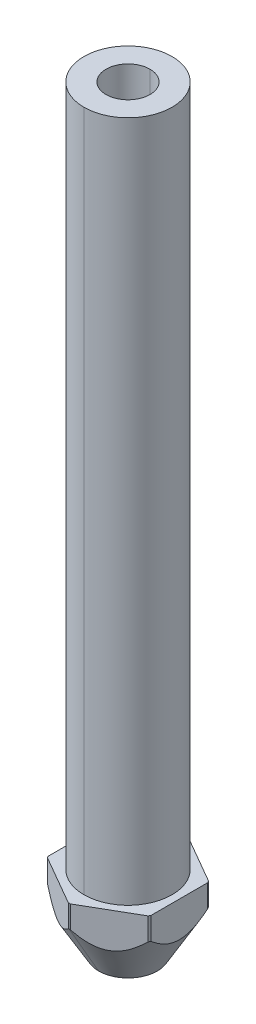
ISO-10303-21;
HEADER;
FILE_DESCRIPTION(('STEP AP214'),'2;1');
FILE_NAME('part.step','',(''),(''),'','','');
FILE_SCHEMA(('AUTOMOTIVE_DESIGN { 1 0 10303 214 1 1 1 1 }'));
ENDSEC;
DATA;
#1=APPLICATION_CONTEXT('core data for automotive mechanical design processes');
#2=APPLICATION_PROTOCOL_DEFINITION('international standard','automotive_design',2000,#1);
#3=PRODUCT_CONTEXT('',#1,'mechanical');
#4=PRODUCT('Part','Part','',(#3));
#5=PRODUCT_RELATED_PRODUCT_CATEGORY('part','',(#4));
#6=PRODUCT_DEFINITION_FORMATION('','',#4);
#7=PRODUCT_DEFINITION_CONTEXT('part definition',#1,'design');
#8=PRODUCT_DEFINITION('design','',#6,#7);
#9=PRODUCT_DEFINITION_SHAPE('','',#8);
#10=(LENGTH_UNIT() NAMED_UNIT(*) SI_UNIT(.MILLI.,.METRE.));
#11=(NAMED_UNIT(*) PLANE_ANGLE_UNIT() SI_UNIT($,.RADIAN.));
#12=(NAMED_UNIT(*) SI_UNIT($,.STERADIAN.) SOLID_ANGLE_UNIT());
#13=UNCERTAINTY_MEASURE_WITH_UNIT(LENGTH_MEASURE(1.E-05),#10,'distance_accuracy_value','');
#14=(GEOMETRIC_REPRESENTATION_CONTEXT(3) GLOBAL_UNCERTAINTY_ASSIGNED_CONTEXT((#13)) GLOBAL_UNIT_ASSIGNED_CONTEXT((#10,
#11,#12)) REPRESENTATION_CONTEXT('',''));
#15=CARTESIAN_POINT('',(0.,0.,0.));
#16=DIRECTION('',(0.,0.,1.));
#17=DIRECTION('',(1.,0.,0.));
#18=AXIS2_PLACEMENT_3D('',#15,#16,#17);
#19=CARTESIAN_POINT('',(0.,0.,0.));
#20=DIRECTION('',(0.,1.,0.));
#21=DIRECTION('',(0.,0.,1.));
#22=AXIS2_PLACEMENT_3D('',#19,#20,#21);
#23=CYLINDRICAL_SURFACE('',#22,1.5);
#24=DIRECTION('',(0.,1.,0.));
#25=VECTOR('',#24,1.);
#26=CARTESIAN_POINT('',(0.,0.,-1.5));
#27=LINE('',#26,#25);
#28=CARTESIAN_POINT('',(0.,-51.5,-1.5));
#29=VERTEX_POINT('',#28);
#30=CARTESIAN_POINT('',(0.,0.,-1.5));
#31=VERTEX_POINT('',#30);
#32=EDGE_CURVE('E218',#29,#31,#27,.T.);
#33=ORIENTED_EDGE('',*,*,#32,.F.);
#34=CARTESIAN_POINT('',(0.,-51.5,0.));
#35=DIRECTION('',(0.,1.,0.));
#36=DIRECTION('',(0.,0.,1.));
#37=AXIS2_PLACEMENT_3D('',#34,#35,#36);
#38=CIRCLE('',#37,1.5);
#39=CARTESIAN_POINT('',(0.,-51.5,1.5));
#40=VERTEX_POINT('',#39);
#41=EDGE_CURVE('E206',#40,#29,#38,.T.);
#42=ORIENTED_EDGE('',*,*,#41,.F.);
#43=DIRECTION('',(0.,1.,0.));
#44=VECTOR('',#43,1.);
#45=CARTESIAN_POINT('',(0.,0.,1.5));
#46=LINE('',#45,#44);
#47=CARTESIAN_POINT('',(0.,0.,1.5));
#48=VERTEX_POINT('',#47);
#49=EDGE_CURVE('E227',#40,#48,#46,.T.);
#50=ORIENTED_EDGE('',*,*,#49,.T.);
#51=CARTESIAN_POINT('',(0.,0.,0.));
#52=DIRECTION('',(0.,1.,0.));
#53=DIRECTION('',(0.,0.,1.));
#54=AXIS2_PLACEMENT_3D('',#51,#52,#53);
#55=CIRCLE('',#54,1.5);
#56=EDGE_CURVE('E219',#48,#31,#55,.T.);
#57=ORIENTED_EDGE('',*,*,#56,.T.);
#58=EDGE_LOOP('',(#33,#42,#50,#57));
#59=FACE_BOUND('',#58,.T.);
#60=ADVANCED_FACE('F17',(#59),#23,.F.);
#61=CARTESIAN_POINT('',(0.,0.,0.));
#62=DIRECTION('',(0.,1.,0.));
#63=DIRECTION('',(0.,0.,1.));
#64=AXIS2_PLACEMENT_3D('',#61,#62,#63);
#65=CYLINDRICAL_SURFACE('',#64,3.);
#66=DIRECTION('',(0.,1.,0.));
#67=VECTOR('',#66,1.);
#68=CARTESIAN_POINT('',(0.,0.,-3.));
#69=LINE('',#68,#67);
#70=CARTESIAN_POINT('',(0.,-46.5,-3.));
#71=VERTEX_POINT('',#70);
#72=CARTESIAN_POINT('',(0.,0.,-3.));
#73=VERTEX_POINT('',#72);
#74=EDGE_CURVE('E416',#71,#73,#69,.T.);
#75=ORIENTED_EDGE('',*,*,#74,.F.);
#76=CARTESIAN_POINT('',(0.,-46.5,0.));
#77=DIRECTION('',(0.,1.,0.));
#78=DIRECTION('',(0.,0.,1.));
#79=AXIS2_PLACEMENT_3D('',#76,#77,#78);
#80=CIRCLE('',#79,3.);
#81=CARTESIAN_POINT('',(0.,-46.5,3.));
#82=VERTEX_POINT('',#81);
#83=EDGE_CURVE('E11',#71,#82,#80,.T.);
#84=ORIENTED_EDGE('',*,*,#83,.T.);
#85=DIRECTION('',(0.,1.,0.));
#86=VECTOR('',#85,1.);
#87=CARTESIAN_POINT('',(0.,0.,3.));
#88=LINE('',#87,#86);
#89=CARTESIAN_POINT('',(0.,0.,3.));
#90=VERTEX_POINT('',#89);
#91=EDGE_CURVE('E367',#82,#90,#88,.T.);
#92=ORIENTED_EDGE('',*,*,#91,.T.);
#93=CARTESIAN_POINT('',(0.,0.,0.));
#94=DIRECTION('',(0.,1.,0.));
#95=DIRECTION('',(0.,0.,1.));
#96=AXIS2_PLACEMENT_3D('',#93,#94,#95);
#97=CIRCLE('',#96,3.);
#98=EDGE_CURVE('E111',#73,#90,#97,.T.);
#99=ORIENTED_EDGE('',*,*,#98,.F.);
#100=EDGE_LOOP('',(#75,#84,#92,#99));
#101=FACE_BOUND('',#100,.T.);
#102=ADVANCED_FACE('F512',(#101),#65,.T.);
#103=CARTESIAN_POINT('',(0.,-51.5,0.));
#104=DIRECTION('',(0.,1.,0.));
#105=DIRECTION('',(0.,0.,1.));
#106=AXIS2_PLACEMENT_3D('',#103,#104,#105);
#107=CONICAL_SURFACE('',#106,2.,0.523598775598299);
#108=DIRECTION('',(0.,0.866025403784439,-0.5));
#109=VECTOR('',#108,1.);
#110=CARTESIAN_POINT('',(0.,-51.5,-2.));
#111=LINE('',#110,#109);
#112=CARTESIAN_POINT('',(0.,-51.5,-2.));
#113=VERTEX_POINT('',#112);
#114=CARTESIAN_POINT('',(0.,-48.0358983848622,-4.));
#115=VERTEX_POINT('',#114);
#116=EDGE_CURVE('E21',#113,#115,#111,.T.);
#117=ORIENTED_EDGE('',*,*,#116,.F.);
#118=CARTESIAN_POINT('',(0.,-51.5,0.));
#119=DIRECTION('',(0.,1.,0.));
#120=DIRECTION('',(0.,0.,1.));
#121=AXIS2_PLACEMENT_3D('',#118,#119,#120);
#122=CIRCLE('',#121,2.);
#123=CARTESIAN_POINT('',(0.,-51.5,2.));
#124=VERTEX_POINT('',#123);
#125=EDGE_CURVE('E96',#113,#124,#122,.T.);
#126=ORIENTED_EDGE('',*,*,#125,.T.);
#127=DIRECTION('',(0.,0.866025403784439,0.5));
#128=VECTOR('',#127,1.);
#129=CARTESIAN_POINT('',(0.,-51.5,2.));
#130=LINE('',#129,#128);
#131=CARTESIAN_POINT('',(0.,-48.0358983848622,4.));
#132=VERTEX_POINT('',#131);
#133=EDGE_CURVE('E307',#124,#132,#130,.T.);
#134=ORIENTED_EDGE('',*,*,#133,.T.);
#135=CARTESIAN_POINT('',(0.,-48.0358983848622,0.));
#136=DIRECTION('',(0.,1.,0.));
#137=DIRECTION('',(0.,0.,1.));
#138=AXIS2_PLACEMENT_3D('',#135,#136,#137);
#139=CIRCLE('',#138,4.);
#140=CARTESIAN_POINT('',(-0.0729490168751533,-48.0358983848622,3.99933474979739));
#141=VERTEX_POINT('',#140);
#142=EDGE_CURVE('E309',#141,#132,#139,.T.);
#143=ORIENTED_EDGE('',*,*,#142,.F.);
#144=CARTESIAN_POINT('',(-3.42705098312485,-48.0358983848623,2.06284307669368));
#145=CARTESIAN_POINT('',(-1.75000000000001,-49.6596960169581,3.03108891324553));
#146=CARTESIAN_POINT('',(-0.0729490168751533,-48.0358983848623,3.99933474979739));
#147=(BOUNDED_CURVE() B_SPLINE_CURVE(2,(#144,#145,#146),.UNSPECIFIED.,.F.,
.F.) B_SPLINE_CURVE_WITH_KNOTS((3,3),(-0.838145031465155,-0.242215869795367),
.UNSPECIFIED.) CURVE() GEOMETRIC_REPRESENTATION_ITEM() RATIONAL_B_SPLINE_CURVE((1.19521354868503,
1.36595834135432,1.19521354868503)) REPRESENTATION_ITEM(''));
#148=CARTESIAN_POINT('',(-3.42705098312485,-48.0358983848622,2.06284307669368));
#149=VERTEX_POINT('',#148);
#150=EDGE_CURVE('E256',#149,#141,#147,.T.);
#151=ORIENTED_EDGE('',*,*,#150,.F.);
#152=CARTESIAN_POINT('',(0.,-48.0358983848622,0.));
#153=DIRECTION('',(0.,1.,0.));
#154=DIRECTION('',(0.,0.,1.));
#155=AXIS2_PLACEMENT_3D('',#152,#153,#154);
#156=CIRCLE('',#155,4.);
#157=CARTESIAN_POINT('',(-3.5,-48.0358983848622,1.93649167310372));
#158=VERTEX_POINT('',#157);
#159=EDGE_CURVE('E43',#158,#149,#156,.T.);
#160=ORIENTED_EDGE('',*,*,#159,.F.);
#161=CARTESIAN_POINT('',(-3.5,-48.0358983848623,-1.93649167310372));
#162=CARTESIAN_POINT('',(-3.5,-49.6596960169581,0.));
#163=CARTESIAN_POINT('',(-3.5,-48.0358983848623,1.93649167310372));
#164=(BOUNDED_CURVE() B_SPLINE_CURVE(2,(#161,#162,#163),.UNSPECIFIED.,.F.,
.F.) B_SPLINE_CURVE_WITH_KNOTS((3,3),(-0.838145031465153,-0.242215869795367),
.UNSPECIFIED.) CURVE() GEOMETRIC_REPRESENTATION_ITEM() RATIONAL_B_SPLINE_CURVE((1.19521354868503,
1.36595834135432,1.19521354868503)) REPRESENTATION_ITEM(''));
#165=CARTESIAN_POINT('',(-3.5,-48.0358983848622,-1.93649167310372));
#166=VERTEX_POINT('',#165);
#167=EDGE_CURVE('E246',#166,#158,#164,.T.);
#168=ORIENTED_EDGE('',*,*,#167,.F.);
#169=CARTESIAN_POINT('',(0.,-48.0358983848622,0.));
#170=DIRECTION('',(0.,1.,0.));
#171=DIRECTION('',(0.,0.,1.));
#172=AXIS2_PLACEMENT_3D('',#169,#170,#171);
#173=CIRCLE('',#172,4.);
#174=CARTESIAN_POINT('',(-3.42705098312485,-48.0358983848622,-2.06284307669368));
#175=VERTEX_POINT('',#174);
#176=EDGE_CURVE('E297',#175,#166,#173,.T.);
#177=ORIENTED_EDGE('',*,*,#176,.F.);
#178=CARTESIAN_POINT('',(-0.0729490168751544,-48.0358983848623,-3.99933474979739));
#179=CARTESIAN_POINT('',(-1.75,-49.6596960169581,-3.03108891324553));
#180=CARTESIAN_POINT('',(-3.42705098312485,-48.0358983848623,-2.06284307669368));
#181=(BOUNDED_CURVE() B_SPLINE_CURVE(2,(#178,#179,#180),.UNSPECIFIED.,.F.,
.F.) B_SPLINE_CURVE_WITH_KNOTS((3,3),(-0.838145031465148,-0.242215869795368),
.UNSPECIFIED.) CURVE() GEOMETRIC_REPRESENTATION_ITEM() RATIONAL_B_SPLINE_CURVE((1.19521354868503,
1.36595834135431,1.19521354868503)) REPRESENTATION_ITEM(''));
#182=CARTESIAN_POINT('',(-0.0729490168751544,-48.0358983848622,-3.99933474979739));
#183=VERTEX_POINT('',#182);
#184=EDGE_CURVE('E257',#183,#175,#181,.T.);
#185=ORIENTED_EDGE('',*,*,#184,.F.);
#186=CARTESIAN_POINT('',(0.,-48.0358983848622,0.));
#187=DIRECTION('',(0.,1.,0.));
#188=DIRECTION('',(0.,0.,1.));
#189=AXIS2_PLACEMENT_3D('',#186,#187,#188);
#190=CIRCLE('',#189,4.);
#191=EDGE_CURVE('E274',#115,#183,#190,.T.);
#192=ORIENTED_EDGE('',*,*,#191,.F.);
#193=EDGE_LOOP('',(#117,#126,#134,#143,#151,#160,#168,#177,#185,#192));
#194=FACE_BOUND('',#193,.T.);
#195=ADVANCED_FACE('F443',(#194),#107,.T.);
#196=CARTESIAN_POINT('',(0.,0.,0.));
#197=DIRECTION('',(0.,1.,0.));
#198=DIRECTION('',(0.,0.,1.));
#199=AXIS2_PLACEMENT_3D('',#196,#197,#198);
#200=CYLINDRICAL_SURFACE('',#199,4.);
#201=DIRECTION('',(0.,1.,0.));
#202=VECTOR('',#201,1.);
#203=CARTESIAN_POINT('',(0.,0.,4.));
#204=LINE('',#203,#202);
#205=CARTESIAN_POINT('',(0.,-46.5,4.));
#206=VERTEX_POINT('',#205);
#207=EDGE_CURVE('E306',#132,#206,#204,.T.);
#208=ORIENTED_EDGE('',*,*,#207,.F.);
#209=CARTESIAN_POINT('',(0.,-48.0358983848622,0.));
#210=DIRECTION('',(0.,1.,0.));
#211=DIRECTION('',(0.,0.,1.));
#212=AXIS2_PLACEMENT_3D('',#209,#210,#211);
#213=CIRCLE('',#212,4.);
#214=CARTESIAN_POINT('',(0.0729490168751524,-48.0358983848622,3.99933474979739));
#215=VERTEX_POINT('',#214);
#216=EDGE_CURVE('E310',#132,#215,#213,.T.);
#217=ORIENTED_EDGE('',*,*,#216,.T.);
#218=DIRECTION('',(0.,-1.,0.));
#219=VECTOR('',#218,1.);
#220=CARTESIAN_POINT('',(0.0729490168751524,0.,3.99933474979739));
#221=LINE('',#220,#219);
#222=CARTESIAN_POINT('',(0.0729490168751524,-46.5,3.99933474979739));
#223=VERTEX_POINT('',#222);
#224=EDGE_CURVE('E251',#223,#215,#221,.T.);
#225=ORIENTED_EDGE('',*,*,#224,.F.);
#226=CARTESIAN_POINT('',(0.,-46.5,0.));
#227=DIRECTION('',(0.,1.,0.));
#228=DIRECTION('',(0.,0.,1.));
#229=AXIS2_PLACEMENT_3D('',#226,#227,#228);
#230=CIRCLE('',#229,4.);
#231=EDGE_CURVE('E28',#206,#223,#230,.T.);
#232=ORIENTED_EDGE('',*,*,#231,.F.);
#233=EDGE_LOOP('',(#208,#217,#225,#232));
#234=FACE_BOUND('',#233,.T.);
#235=ADVANCED_FACE('F538',(#234),#200,.T.);
#236=CARTESIAN_POINT('',(0.,-46.5,0.));
#237=DIRECTION('',(0.,1.,0.));
#238=DIRECTION('',(1.,0.,0.));
#239=AXIS2_PLACEMENT_3D('',#236,#237,#238);
#240=PLANE('',#239);
#241=CARTESIAN_POINT('',(0.,-46.5,0.));
#242=DIRECTION('',(0.,1.,0.));
#243=DIRECTION('',(0.,0.,1.));
#244=AXIS2_PLACEMENT_3D('',#241,#242,#243);
#245=CIRCLE('',#244,3.);
#246=EDGE_CURVE('E345',#82,#71,#245,.T.);
#247=ORIENTED_EDGE('',*,*,#246,.F.);
#248=ORIENTED_EDGE('',*,*,#83,.F.);
#249=EDGE_LOOP('',(#247,#248));
#250=FACE_BOUND('',#249,.T.);
#251=CARTESIAN_POINT('',(0.,-46.5,0.));
#252=DIRECTION('',(0.,1.,0.));
#253=DIRECTION('',(0.,0.,1.));
#254=AXIS2_PLACEMENT_3D('',#251,#252,#253);
#255=CIRCLE('',#254,4.);
#256=CARTESIAN_POINT('',(-3.42705098312485,-46.5,-2.06284307669368));
#257=VERTEX_POINT('',#256);
#258=CARTESIAN_POINT('',(-3.5,-46.5,-1.93649167310372));
#259=VERTEX_POINT('',#258);
#260=EDGE_CURVE('E300',#257,#259,#255,.T.);
#261=ORIENTED_EDGE('',*,*,#260,.T.);
#262=DIRECTION('',(0.,0.,1.));
#263=VECTOR('',#262,1.);
#264=CARTESIAN_POINT('',(-3.5,-46.5,0.));
#265=LINE('',#264,#263);
#266=CARTESIAN_POINT('',(-3.5,-46.5,1.93649167310372));
#267=VERTEX_POINT('',#266);
#268=EDGE_CURVE('E245',#259,#267,#265,.T.);
#269=ORIENTED_EDGE('',*,*,#268,.T.);
#270=CARTESIAN_POINT('',(0.,-46.5,0.));
#271=DIRECTION('',(0.,1.,0.));
#272=DIRECTION('',(0.,0.,1.));
#273=AXIS2_PLACEMENT_3D('',#270,#271,#272);
#274=CIRCLE('',#273,4.);
#275=CARTESIAN_POINT('',(-3.42705098312485,-46.5,2.06284307669368));
#276=VERTEX_POINT('',#275);
#277=EDGE_CURVE('E241',#267,#276,#274,.T.);
#278=ORIENTED_EDGE('',*,*,#277,.T.);
#279=DIRECTION('',(0.866025403784439,0.,0.5));
#280=VECTOR('',#279,1.);
#281=CARTESIAN_POINT('',(-1.75,-46.5,3.03108891324554));
#282=LINE('',#281,#280);
#283=CARTESIAN_POINT('',(-0.0729490168751533,-46.5,3.99933474979739));
#284=VERTEX_POINT('',#283);
#285=EDGE_CURVE('E252',#276,#284,#282,.T.);
#286=ORIENTED_EDGE('',*,*,#285,.T.);
#287=CARTESIAN_POINT('',(0.,-46.5,0.));
#288=DIRECTION('',(0.,1.,0.));
#289=DIRECTION('',(0.,0.,1.));
#290=AXIS2_PLACEMENT_3D('',#287,#288,#289);
#291=CIRCLE('',#290,4.);
#292=EDGE_CURVE('E301',#284,#206,#291,.T.);
#293=ORIENTED_EDGE('',*,*,#292,.T.);
#294=ORIENTED_EDGE('',*,*,#231,.T.);
#295=DIRECTION('',(0.866025403784439,0.,-0.5));
#296=VECTOR('',#295,1.);
#297=CARTESIAN_POINT('',(1.75,-46.5,3.03108891324554));
#298=LINE('',#297,#296);
#299=CARTESIAN_POINT('',(3.42705098312485,-46.5,2.06284307669368));
#300=VERTEX_POINT('',#299);
#301=EDGE_CURVE('E250',#223,#300,#298,.T.);
#302=ORIENTED_EDGE('',*,*,#301,.T.);
#303=CARTESIAN_POINT('',(0.,-46.5,0.));
#304=DIRECTION('',(0.,1.,0.));
#305=DIRECTION('',(0.,0.,1.));
#306=AXIS2_PLACEMENT_3D('',#303,#304,#305);
#307=CIRCLE('',#306,4.);
#308=CARTESIAN_POINT('',(3.5,-46.5,1.93649167310372));
#309=VERTEX_POINT('',#308);
#310=EDGE_CURVE('E177',#300,#309,#307,.T.);
#311=ORIENTED_EDGE('',*,*,#310,.T.);
#312=DIRECTION('',(0.,0.,-1.));
#313=VECTOR('',#312,1.);
#314=CARTESIAN_POINT('',(3.5,-46.5,0.));
#315=LINE('',#314,#313);
#316=CARTESIAN_POINT('',(3.5,-46.5,-1.93649167310372));
#317=VERTEX_POINT('',#316);
#318=EDGE_CURVE('E281',#309,#317,#315,.T.);
#319=ORIENTED_EDGE('',*,*,#318,.T.);
#320=CARTESIAN_POINT('',(0.,-46.5,0.));
#321=DIRECTION('',(0.,1.,0.));
#322=DIRECTION('',(0.,0.,1.));
#323=AXIS2_PLACEMENT_3D('',#320,#321,#322);
#324=CIRCLE('',#323,4.);
#325=CARTESIAN_POINT('',(3.42705098312485,-46.5,-2.06284307669368));
#326=VERTEX_POINT('',#325);
#327=EDGE_CURVE('E188',#317,#326,#324,.T.);
#328=ORIENTED_EDGE('',*,*,#327,.T.);
#329=DIRECTION('',(-0.866025403784439,0.,-0.5));
#330=VECTOR('',#329,1.);
#331=CARTESIAN_POINT('',(1.75,-46.5,-3.03108891324554));
#332=LINE('',#331,#330);
#333=CARTESIAN_POINT('',(0.0729490168751509,-46.5,-3.99933474979739));
#334=VERTEX_POINT('',#333);
#335=EDGE_CURVE('E273',#326,#334,#332,.T.);
#336=ORIENTED_EDGE('',*,*,#335,.T.);
#337=CARTESIAN_POINT('',(0.,-46.5,0.));
#338=DIRECTION('',(0.,1.,0.));
#339=DIRECTION('',(0.,0.,1.));
#340=AXIS2_PLACEMENT_3D('',#337,#338,#339);
#341=CIRCLE('',#340,4.);
#342=CARTESIAN_POINT('',(0.,-46.5,-4.));
#343=VERTEX_POINT('',#342);
#344=EDGE_CURVE('E286',#334,#343,#341,.T.);
#345=ORIENTED_EDGE('',*,*,#344,.T.);
#346=CARTESIAN_POINT('',(0.,-46.5,0.));
#347=DIRECTION('',(0.,1.,0.));
#348=DIRECTION('',(0.,0.,1.));
#349=AXIS2_PLACEMENT_3D('',#346,#347,#348);
#350=CIRCLE('',#349,4.);
#351=CARTESIAN_POINT('',(-0.0729490168751544,-46.5,-3.99933474979739));
#352=VERTEX_POINT('',#351);
#353=EDGE_CURVE('E277',#343,#352,#350,.T.);
#354=ORIENTED_EDGE('',*,*,#353,.T.);
#355=DIRECTION('',(-0.866025403784439,0.,0.5));
#356=VECTOR('',#355,1.);
#357=CARTESIAN_POINT('',(-1.75,-46.5,-3.03108891324554));
#358=LINE('',#357,#356);
#359=EDGE_CURVE('E290',#352,#257,#358,.T.);
#360=ORIENTED_EDGE('',*,*,#359,.T.);
#361=EDGE_LOOP('',(#261,#269,#278,#286,#293,#294,#302,#311,#319,#328,#336,#345,#354,#360));
#362=FACE_BOUND('',#361,.T.);
#363=ADVANCED_FACE('F452',(#250,#362),#240,.T.);
#364=CARTESIAN_POINT('',(0.,0.,0.));
#365=DIRECTION('',(0.,1.,0.));
#366=DIRECTION('',(0.,0.,1.));
#367=AXIS2_PLACEMENT_3D('',#364,#365,#366);
#368=CYLINDRICAL_SURFACE('',#367,4.);
#369=DIRECTION('',(0.,-1.,0.));
#370=VECTOR('',#369,1.);
#371=CARTESIAN_POINT('',(-3.5,0.,1.93649167310372));
#372=LINE('',#371,#370);
#373=EDGE_CURVE('E242',#267,#158,#372,.T.);
#374=ORIENTED_EDGE('',*,*,#373,.T.);
#375=ORIENTED_EDGE('',*,*,#159,.T.);
#376=DIRECTION('',(0.,-1.,0.));
#377=VECTOR('',#376,1.);
#378=CARTESIAN_POINT('',(-3.42705098312485,0.,2.06284307669368));
#379=LINE('',#378,#377);
#380=EDGE_CURVE('E394',#276,#149,#379,.T.);
#381=ORIENTED_EDGE('',*,*,#380,.F.);
#382=ORIENTED_EDGE('',*,*,#277,.F.);
#383=EDGE_LOOP('',(#374,#375,#381,#382));
#384=FACE_BOUND('',#383,.T.);
#385=ADVANCED_FACE('F450',(#384),#368,.T.);
#386=CARTESIAN_POINT('',(0.,0.,0.));
#387=DIRECTION('',(0.,1.,0.));
#388=DIRECTION('',(0.,0.,1.));
#389=AXIS2_PLACEMENT_3D('',#386,#387,#388);
#390=CYLINDRICAL_SURFACE('',#389,4.);
#391=DIRECTION('',(0.,-1.,0.));
#392=VECTOR('',#391,1.);
#393=CARTESIAN_POINT('',(-3.5,0.,-1.93649167310372));
#394=LINE('',#393,#392);
#395=EDGE_CURVE('E285',#259,#166,#394,.T.);
#396=ORIENTED_EDGE('',*,*,#395,.F.);
#397=ORIENTED_EDGE('',*,*,#260,.F.);
#398=DIRECTION('',(0.,-1.,0.));
#399=VECTOR('',#398,1.);
#400=CARTESIAN_POINT('',(-3.42705098312485,0.,-2.06284307669368));
#401=LINE('',#400,#399);
#402=EDGE_CURVE('E263',#257,#175,#401,.T.);
#403=ORIENTED_EDGE('',*,*,#402,.T.);
#404=ORIENTED_EDGE('',*,*,#176,.T.);
#405=EDGE_LOOP('',(#396,#397,#403,#404));
#406=FACE_BOUND('',#405,.T.);
#407=ADVANCED_FACE('F454',(#406),#390,.T.);
#408=CARTESIAN_POINT('',(0.,0.,0.));
#409=DIRECTION('',(0.,1.,0.));
#410=DIRECTION('',(0.,0.,-1.));
#411=AXIS2_PLACEMENT_3D('',#408,#409,#410);
#412=CYLINDRICAL_SURFACE('',#411,4.);
#413=DIRECTION('',(0.,1.,0.));
#414=VECTOR('',#413,1.);
#415=CARTESIAN_POINT('',(0.,0.,-4.));
#416=LINE('',#415,#414);
#417=EDGE_CURVE('E401',#115,#343,#416,.T.);
#418=ORIENTED_EDGE('',*,*,#417,.F.);
#419=ORIENTED_EDGE('',*,*,#191,.T.);
#420=DIRECTION('',(0.,-1.,0.));
#421=VECTOR('',#420,1.);
#422=CARTESIAN_POINT('',(-0.0729490168751544,0.,-3.99933474979739));
#423=LINE('',#422,#421);
#424=EDGE_CURVE('E264',#352,#183,#423,.T.);
#425=ORIENTED_EDGE('',*,*,#424,.F.);
#426=ORIENTED_EDGE('',*,*,#353,.F.);
#427=EDGE_LOOP('',(#418,#419,#425,#426));
#428=FACE_BOUND('',#427,.T.);
#429=ADVANCED_FACE('F467',(#428),#412,.T.);
#430=CARTESIAN_POINT('',(0.,0.,0.));
#431=DIRECTION('',(0.,1.,0.));
#432=DIRECTION('',(0.,0.,1.));
#433=AXIS2_PLACEMENT_3D('',#430,#431,#432);
#434=CYLINDRICAL_SURFACE('',#433,4.);
#435=DIRECTION('',(0.,-1.,0.));
#436=VECTOR('',#435,1.);
#437=CARTESIAN_POINT('',(3.42705098312485,0.,-2.06284307669368));
#438=LINE('',#437,#436);
#439=CARTESIAN_POINT('',(3.42705098312485,-48.0358983848622,-2.06284307669368));
#440=VERTEX_POINT('',#439);
#441=EDGE_CURVE('E294',#326,#440,#438,.T.);
#442=ORIENTED_EDGE('',*,*,#441,.F.);
#443=ORIENTED_EDGE('',*,*,#327,.F.);
#444=DIRECTION('',(0.,-1.,0.));
#445=VECTOR('',#444,1.);
#446=CARTESIAN_POINT('',(3.5,0.,-1.93649167310372));
#447=LINE('',#446,#445);
#448=CARTESIAN_POINT('',(3.5,-48.0358983848622,-1.93649167310372));
#449=VERTEX_POINT('',#448);
#450=EDGE_CURVE('E272',#317,#449,#447,.T.);
#451=ORIENTED_EDGE('',*,*,#450,.T.);
#452=CARTESIAN_POINT('',(0.,-48.0358983848622,0.));
#453=DIRECTION('',(0.,1.,0.));
#454=DIRECTION('',(0.,0.,1.));
#455=AXIS2_PLACEMENT_3D('',#452,#453,#454);
#456=CIRCLE('',#455,4.);
#457=EDGE_CURVE('E328',#449,#440,#456,.T.);
#458=ORIENTED_EDGE('',*,*,#457,.T.);
#459=EDGE_LOOP('',(#442,#443,#451,#458));
#460=FACE_BOUND('',#459,.T.);
#461=ADVANCED_FACE('F564',(#460),#434,.T.);
#462=CARTESIAN_POINT('',(0.,0.,0.));
#463=DIRECTION('',(0.,1.,0.));
#464=DIRECTION('',(0.,0.,1.));
#465=AXIS2_PLACEMENT_3D('',#462,#463,#464);
#466=CYLINDRICAL_SURFACE('',#465,4.);
#467=DIRECTION('',(0.,-1.,0.));
#468=VECTOR('',#467,1.);
#469=CARTESIAN_POINT('',(3.5,0.,1.93649167310372));
#470=LINE('',#469,#468);
#471=CARTESIAN_POINT('',(3.5,-48.0358983848622,1.93649167310372));
#472=VERTEX_POINT('',#471);
#473=EDGE_CURVE('E265',#309,#472,#470,.T.);
#474=ORIENTED_EDGE('',*,*,#473,.F.);
#475=ORIENTED_EDGE('',*,*,#310,.F.);
#476=DIRECTION('',(0.,-1.,0.));
#477=VECTOR('',#476,1.);
#478=CARTESIAN_POINT('',(3.42705098312485,0.,2.06284307669368));
#479=LINE('',#478,#477);
#480=CARTESIAN_POINT('',(3.42705098312485,-48.0358983848622,2.06284307669368));
#481=VERTEX_POINT('',#480);
#482=EDGE_CURVE('E247',#300,#481,#479,.T.);
#483=ORIENTED_EDGE('',*,*,#482,.T.);
#484=CARTESIAN_POINT('',(0.,-48.0358983848622,0.));
#485=DIRECTION('',(0.,1.,0.));
#486=DIRECTION('',(0.,0.,1.));
#487=AXIS2_PLACEMENT_3D('',#484,#485,#486);
#488=CIRCLE('',#487,4.);
#489=EDGE_CURVE('E311',#481,#472,#488,.T.);
#490=ORIENTED_EDGE('',*,*,#489,.T.);
#491=EDGE_LOOP('',(#474,#475,#483,#490));
#492=FACE_BOUND('',#491,.T.);
#493=ADVANCED_FACE('F526',(#492),#466,.T.);
#494=CARTESIAN_POINT('',(0.,-51.5,0.));
#495=DIRECTION('',(0.,1.,0.));
#496=DIRECTION('',(1.,0.,0.));
#497=AXIS2_PLACEMENT_3D('',#494,#495,#496);
#498=PLANE('',#497);
#499=ORIENTED_EDGE('',*,*,#41,.T.);
#500=CARTESIAN_POINT('',(0.,-51.5,0.));
#501=DIRECTION('',(0.,1.,0.));
#502=DIRECTION('',(0.,0.,1.));
#503=AXIS2_PLACEMENT_3D('',#500,#501,#502);
#504=CIRCLE('',#503,1.5);
#505=EDGE_CURVE('E211',#29,#40,#504,.T.);
#506=ORIENTED_EDGE('',*,*,#505,.T.);
#507=EDGE_LOOP('',(#499,#506));
#508=FACE_BOUND('',#507,.T.);
#509=CARTESIAN_POINT('',(0.,-51.5,0.));
#510=DIRECTION('',(0.,1.,0.));
#511=DIRECTION('',(0.,0.,1.));
#512=AXIS2_PLACEMENT_3D('',#509,#510,#511);
#513=CIRCLE('',#512,2.);
#514=EDGE_CURVE('E369',#124,#113,#513,.T.);
#515=ORIENTED_EDGE('',*,*,#514,.F.);
#516=ORIENTED_EDGE('',*,*,#125,.F.);
#517=EDGE_LOOP('',(#515,#516));
#518=FACE_BOUND('',#517,.T.);
#519=ADVANCED_FACE('F208',(#508,#518),#498,.F.);
#520=CARTESIAN_POINT('',(0.,0.,0.));
#521=DIRECTION('',(0.,1.,0.));
#522=DIRECTION('',(1.,0.,0.));
#523=AXIS2_PLACEMENT_3D('',#520,#521,#522);
#524=PLANE('',#523);
#525=ORIENTED_EDGE('',*,*,#56,.F.);
#526=CARTESIAN_POINT('',(0.,0.,0.));
#527=DIRECTION('',(0.,1.,0.));
#528=DIRECTION('',(0.,0.,1.));
#529=AXIS2_PLACEMENT_3D('',#526,#527,#528);
#530=CIRCLE('',#529,1.5);
#531=EDGE_CURVE('E224',#31,#48,#530,.T.);
#532=ORIENTED_EDGE('',*,*,#531,.F.);
#533=EDGE_LOOP('',(#525,#532));
#534=FACE_BOUND('',#533,.T.);
#535=CARTESIAN_POINT('',(0.,0.,0.));
#536=DIRECTION('',(0.,1.,0.));
#537=DIRECTION('',(0.,0.,1.));
#538=AXIS2_PLACEMENT_3D('',#535,#536,#537);
#539=CIRCLE('',#538,3.);
#540=EDGE_CURVE('E370',#90,#73,#539,.T.);
#541=ORIENTED_EDGE('',*,*,#540,.T.);
#542=ORIENTED_EDGE('',*,*,#98,.T.);
#543=EDGE_LOOP('',(#541,#542));
#544=FACE_BOUND('',#543,.T.);
#545=ADVANCED_FACE('F513',(#534,#544),#524,.T.);
#546=CARTESIAN_POINT('',(-1.75,0.,3.03108891324554));
#547=DIRECTION('',(-0.5,0.,0.866025403784439));
#548=DIRECTION('',(0.,1.,0.));
#549=AXIS2_PLACEMENT_3D('',#546,#547,#548);
#550=PLANE('',#549);
#551=ORIENTED_EDGE('',*,*,#380,.T.);
#552=ORIENTED_EDGE('',*,*,#150,.T.);
#553=DIRECTION('',(0.,-1.,0.));
#554=VECTOR('',#553,1.);
#555=CARTESIAN_POINT('',(-0.0729490168751533,0.,3.99933474979739));
#556=LINE('',#555,#554);
#557=EDGE_CURVE('E305',#284,#141,#556,.T.);
#558=ORIENTED_EDGE('',*,*,#557,.F.);
#559=ORIENTED_EDGE('',*,*,#285,.F.);
#560=EDGE_LOOP('',(#551,#552,#558,#559));
#561=FACE_BOUND('',#560,.T.);
#562=ADVANCED_FACE('F515',(#561),#550,.T.);
#563=CARTESIAN_POINT('',(1.75,0.,3.03108891324554));
#564=DIRECTION('',(0.5,0.,0.866025403784439));
#565=DIRECTION('',(0.,-1.,0.));
#566=AXIS2_PLACEMENT_3D('',#563,#564,#565);
#567=PLANE('',#566);
#568=ORIENTED_EDGE('',*,*,#224,.T.);
#569=CARTESIAN_POINT('',(0.0729490168751525,-48.0358983848623,3.99933474979739));
#570=CARTESIAN_POINT('',(1.75,-49.6596960169581,3.03108891324553));
#571=CARTESIAN_POINT('',(3.42705098312485,-48.0358983848623,2.06284307669368));
#572=(BOUNDED_CURVE() B_SPLINE_CURVE(2,(#569,#570,#571),.UNSPECIFIED.,.F.,
.F.) B_SPLINE_CURVE_WITH_KNOTS((3,3),(-0.838145031465151,-0.242215869795366),
.UNSPECIFIED.) CURVE() GEOMETRIC_REPRESENTATION_ITEM() RATIONAL_B_SPLINE_CURVE((1.19521354868503,
1.36595834135432,1.19521354868503)) REPRESENTATION_ITEM(''));
#573=EDGE_CURVE('E314',#215,#481,#572,.T.);
#574=ORIENTED_EDGE('',*,*,#573,.T.);
#575=ORIENTED_EDGE('',*,*,#482,.F.);
#576=ORIENTED_EDGE('',*,*,#301,.F.);
#577=EDGE_LOOP('',(#568,#574,#575,#576));
#578=FACE_BOUND('',#577,.T.);
#579=ADVANCED_FACE('F523',(#578),#567,.T.);
#580=CARTESIAN_POINT('',(3.5,0.,0.));
#581=DIRECTION('',(1.,0.,0.));
#582=DIRECTION('',(0.,1.,0.));
#583=AXIS2_PLACEMENT_3D('',#580,#581,#582);
#584=PLANE('',#583);
#585=ORIENTED_EDGE('',*,*,#473,.T.);
#586=CARTESIAN_POINT('',(3.5,-48.0358983848623,1.93649167310372));
#587=CARTESIAN_POINT('',(3.5,-49.6596960169581,0.));
#588=CARTESIAN_POINT('',(3.5,-48.0358983848623,-1.93649167310372));
#589=(BOUNDED_CURVE() B_SPLINE_CURVE(2,(#586,#587,#588),.UNSPECIFIED.,.F.,
.F.) B_SPLINE_CURVE_WITH_KNOTS((3,3),(-0.838145031465151,-0.242215869795367),
.UNSPECIFIED.) CURVE() GEOMETRIC_REPRESENTATION_ITEM() RATIONAL_B_SPLINE_CURVE((1.19521354868503,
1.36595834135432,1.19521354868503)) REPRESENTATION_ITEM(''));
#590=EDGE_CURVE('E315',#472,#449,#589,.T.);
#591=ORIENTED_EDGE('',*,*,#590,.T.);
#592=ORIENTED_EDGE('',*,*,#450,.F.);
#593=ORIENTED_EDGE('',*,*,#318,.F.);
#594=EDGE_LOOP('',(#585,#591,#592,#593));
#595=FACE_BOUND('',#594,.T.);
#596=ADVANCED_FACE('F548',(#595),#584,.T.);
#597=CARTESIAN_POINT('',(1.75,0.,-3.03108891324554));
#598=DIRECTION('',(0.5,0.,-0.866025403784439));
#599=DIRECTION('',(0.,-1.,0.));
#600=AXIS2_PLACEMENT_3D('',#597,#598,#599);
#601=PLANE('',#600);
#602=ORIENTED_EDGE('',*,*,#441,.T.);
#603=CARTESIAN_POINT('',(3.42705098312485,-48.0358983848623,-2.06284307669368));
#604=CARTESIAN_POINT('',(1.74999999999999,-49.6596960169581,-3.03108891324554));
#605=CARTESIAN_POINT('',(0.0729490168751509,-48.0358983848623,-3.99933474979739));
#606=(BOUNDED_CURVE() B_SPLINE_CURVE(2,(#603,#604,#605),.UNSPECIFIED.,.F.,
.F.) B_SPLINE_CURVE_WITH_KNOTS((3,3),(-0.838145031465146,-0.242215869795368),
.UNSPECIFIED.) CURVE() GEOMETRIC_REPRESENTATION_ITEM() RATIONAL_B_SPLINE_CURVE((1.19521354868503,
1.36595834135431,1.19521354868503)) REPRESENTATION_ITEM(''));
#607=CARTESIAN_POINT('',(0.0729490168751509,-48.0358983848622,-3.99933474979739));
#608=VERTEX_POINT('',#607);
#609=EDGE_CURVE('E339',#440,#608,#606,.T.);
#610=ORIENTED_EDGE('',*,*,#609,.T.);
#611=DIRECTION('',(0.,-1.,0.));
#612=VECTOR('',#611,1.);
#613=CARTESIAN_POINT('',(0.0729490168751509,0.,-3.99933474979739));
#614=LINE('',#613,#612);
#615=EDGE_CURVE('E282',#334,#608,#614,.T.);
#616=ORIENTED_EDGE('',*,*,#615,.F.);
#617=ORIENTED_EDGE('',*,*,#335,.F.);
#618=EDGE_LOOP('',(#602,#610,#616,#617));
#619=FACE_BOUND('',#618,.T.);
#620=ADVANCED_FACE('F550',(#619),#601,.T.);
#621=CARTESIAN_POINT('',(-1.75,0.,-3.03108891324554));
#622=DIRECTION('',(-0.5,0.,-0.866025403784439));
#623=DIRECTION('',(-0.866025403784439,0.,0.5));
#624=AXIS2_PLACEMENT_3D('',#621,#622,#623);
#625=PLANE('',#624);
#626=ORIENTED_EDGE('',*,*,#424,.T.);
#627=ORIENTED_EDGE('',*,*,#184,.T.);
#628=ORIENTED_EDGE('',*,*,#402,.F.);
#629=ORIENTED_EDGE('',*,*,#359,.F.);
#630=EDGE_LOOP('',(#626,#627,#628,#629));
#631=FACE_BOUND('',#630,.T.);
#632=ADVANCED_FACE('F458',(#631),#625,.T.);
#633=CARTESIAN_POINT('',(-3.5,0.,0.));
#634=DIRECTION('',(-1.,0.,0.));
#635=DIRECTION('',(0.,0.,1.));
#636=AXIS2_PLACEMENT_3D('',#633,#634,#635);
#637=PLANE('',#636);
#638=ORIENTED_EDGE('',*,*,#395,.T.);
#639=ORIENTED_EDGE('',*,*,#167,.T.);
#640=ORIENTED_EDGE('',*,*,#373,.F.);
#641=ORIENTED_EDGE('',*,*,#268,.F.);
#642=EDGE_LOOP('',(#638,#639,#640,#641));
#643=FACE_BOUND('',#642,.T.);
#644=ADVANCED_FACE('F440',(#643),#637,.T.);
#645=CARTESIAN_POINT('',(0.,0.,0.));
#646=DIRECTION('',(0.,1.,0.));
#647=DIRECTION('',(0.,0.,-1.));
#648=AXIS2_PLACEMENT_3D('',#645,#646,#647);
#649=CYLINDRICAL_SURFACE('',#648,4.);
#650=CARTESIAN_POINT('',(0.,-48.0358983848622,0.));
#651=DIRECTION('',(0.,1.,0.));
#652=DIRECTION('',(0.,0.,1.));
#653=AXIS2_PLACEMENT_3D('',#650,#651,#652);
#654=CIRCLE('',#653,4.);
#655=EDGE_CURVE('E236',#608,#115,#654,.T.);
#656=ORIENTED_EDGE('',*,*,#655,.T.);
#657=ORIENTED_EDGE('',*,*,#417,.T.);
#658=ORIENTED_EDGE('',*,*,#344,.F.);
#659=ORIENTED_EDGE('',*,*,#615,.T.);
#660=EDGE_LOOP('',(#656,#657,#658,#659));
#661=FACE_BOUND('',#660,.T.);
#662=ADVANCED_FACE('F19',(#661),#649,.T.);
#663=CARTESIAN_POINT('',(0.,0.,0.));
#664=DIRECTION('',(0.,1.,0.));
#665=DIRECTION('',(0.,0.,1.));
#666=AXIS2_PLACEMENT_3D('',#663,#664,#665);
#667=CYLINDRICAL_SURFACE('',#666,4.);
#668=ORIENTED_EDGE('',*,*,#142,.T.);
#669=ORIENTED_EDGE('',*,*,#207,.T.);
#670=ORIENTED_EDGE('',*,*,#292,.F.);
#671=ORIENTED_EDGE('',*,*,#557,.T.);
#672=EDGE_LOOP('',(#668,#669,#670,#671));
#673=FACE_BOUND('',#672,.T.);
#674=ADVANCED_FACE('F544',(#673),#667,.T.);
#675=CARTESIAN_POINT('',(0.,-51.5,0.));
#676=DIRECTION('',(0.,1.,0.));
#677=DIRECTION('',(0.,0.,1.));
#678=AXIS2_PLACEMENT_3D('',#675,#676,#677);
#679=CONICAL_SURFACE('',#678,2.,0.523598775598299);
#680=ORIENTED_EDGE('',*,*,#514,.T.);
#681=ORIENTED_EDGE('',*,*,#116,.T.);
#682=ORIENTED_EDGE('',*,*,#655,.F.);
#683=ORIENTED_EDGE('',*,*,#609,.F.);
#684=ORIENTED_EDGE('',*,*,#457,.F.);
#685=ORIENTED_EDGE('',*,*,#590,.F.);
#686=ORIENTED_EDGE('',*,*,#489,.F.);
#687=ORIENTED_EDGE('',*,*,#573,.F.);
#688=ORIENTED_EDGE('',*,*,#216,.F.);
#689=ORIENTED_EDGE('',*,*,#133,.F.);
#690=EDGE_LOOP('',(#680,#681,#682,#683,#684,#685,#686,#687,#688,#689));
#691=FACE_BOUND('',#690,.T.);
#692=ADVANCED_FACE('F476',(#691),#679,.T.);
#693=CARTESIAN_POINT('',(0.,0.,0.));
#694=DIRECTION('',(0.,1.,0.));
#695=DIRECTION('',(0.,0.,1.));
#696=AXIS2_PLACEMENT_3D('',#693,#694,#695);
#697=CYLINDRICAL_SURFACE('',#696,3.);
#698=ORIENTED_EDGE('',*,*,#246,.T.);
#699=ORIENTED_EDGE('',*,*,#74,.T.);
#700=ORIENTED_EDGE('',*,*,#540,.F.);
#701=ORIENTED_EDGE('',*,*,#91,.F.);
#702=EDGE_LOOP('',(#698,#699,#700,#701));
#703=FACE_BOUND('',#702,.T.);
#704=ADVANCED_FACE('F510',(#703),#697,.T.);
#705=CARTESIAN_POINT('',(0.,0.,0.));
#706=DIRECTION('',(0.,1.,0.));
#707=DIRECTION('',(0.,0.,1.));
#708=AXIS2_PLACEMENT_3D('',#705,#706,#707);
#709=CYLINDRICAL_SURFACE('',#708,1.5);
#710=ORIENTED_EDGE('',*,*,#505,.F.);
#711=ORIENTED_EDGE('',*,*,#32,.T.);
#712=ORIENTED_EDGE('',*,*,#531,.T.);
#713=ORIENTED_EDGE('',*,*,#49,.F.);
#714=EDGE_LOOP('',(#710,#711,#712,#713));
#715=FACE_BOUND('',#714,.T.);
#716=ADVANCED_FACE('F226',(#715),#709,.F.);
#717=CLOSED_SHELL('',(#60,#102,#195,#235,#363,#385,#407,#429,#461,#493,#519,#545,#562,#579,#596,
#620,#632,#644,#662,#674,#692,#704,#716));
#718=MANIFOLD_SOLID_BREP('B1',#717);
#719=ADVANCED_BREP_SHAPE_REPRESENTATION('',(#18,#718),#14);
#720=SHAPE_DEFINITION_REPRESENTATION(#9,#719);
ENDSEC;
END-ISO-10303-21;
